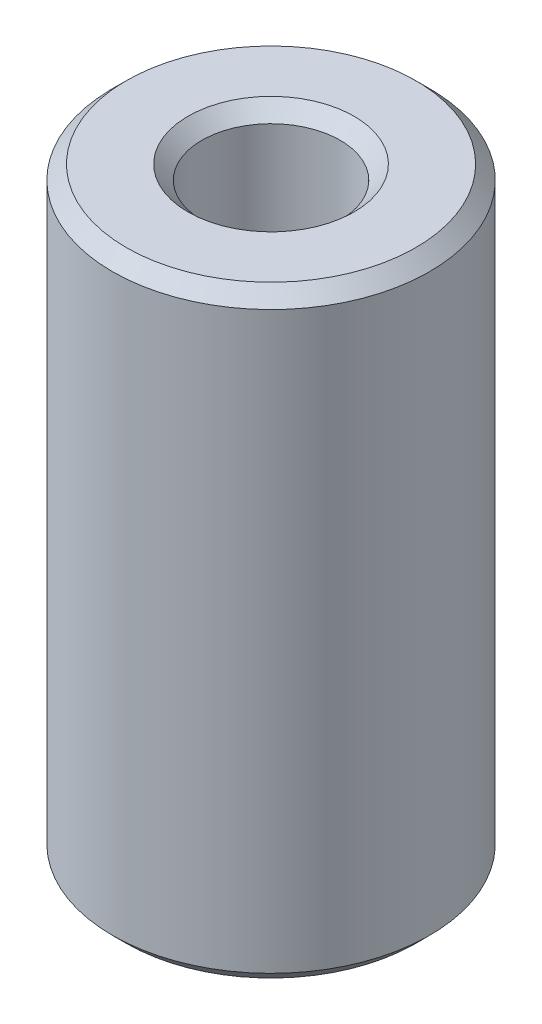
ISO-10303-21;
HEADER;
FILE_DESCRIPTION(('STEP AP214'),'2;1');
FILE_NAME('part.step','',(''),(''),'','','');
FILE_SCHEMA(('AUTOMOTIVE_DESIGN { 1 0 10303 214 1 1 1 1 }'));
ENDSEC;
DATA;
#1=APPLICATION_CONTEXT('core data for automotive mechanical design processes');
#2=APPLICATION_PROTOCOL_DEFINITION('international standard','automotive_design',2000,#1);
#3=PRODUCT_CONTEXT('',#1,'mechanical');
#4=PRODUCT('Part','Part','',(#3));
#5=PRODUCT_RELATED_PRODUCT_CATEGORY('part','',(#4));
#6=PRODUCT_DEFINITION_FORMATION('','',#4);
#7=PRODUCT_DEFINITION_CONTEXT('part definition',#1,'design');
#8=PRODUCT_DEFINITION('design','',#6,#7);
#9=PRODUCT_DEFINITION_SHAPE('','',#8);
#10=(LENGTH_UNIT() NAMED_UNIT(*) SI_UNIT(.MILLI.,.METRE.));
#11=(NAMED_UNIT(*) PLANE_ANGLE_UNIT() SI_UNIT($,.RADIAN.));
#12=(NAMED_UNIT(*) SI_UNIT($,.STERADIAN.) SOLID_ANGLE_UNIT());
#13=UNCERTAINTY_MEASURE_WITH_UNIT(LENGTH_MEASURE(1.E-05),#10,'distance_accuracy_value','');
#14=(GEOMETRIC_REPRESENTATION_CONTEXT(3) GLOBAL_UNCERTAINTY_ASSIGNED_CONTEXT((#13)) GLOBAL_UNIT_ASSIGNED_CONTEXT((#10,
#11,#12)) REPRESENTATION_CONTEXT('',''));
#15=CARTESIAN_POINT('',(0.,0.,0.));
#16=DIRECTION('',(0.,0.,1.));
#17=DIRECTION('',(1.,0.,0.));
#18=AXIS2_PLACEMENT_3D('',#15,#16,#17);
#19=CARTESIAN_POINT('',(0.,152.033433128775,0.));
#20=DIRECTION('',(0.,-1.,0.));
#21=DIRECTION('',(0.,0.,-1.));
#22=AXIS2_PLACEMENT_3D('',#19,#20,#21);
#23=CYLINDRICAL_SURFACE('',#22,40.);
#24=CARTESIAN_POINT('',(0.,3.50004385810501,0.));
#25=DIRECTION('',(0.,1.,0.));
#26=DIRECTION('',(0.,0.,1.));
#27=AXIS2_PLACEMENT_3D('',#24,#25,#26);
#28=CIRCLE('',#27,40.);
#29=CARTESIAN_POINT('',(0.,3.50004385810501,40.));
#30=VERTEX_POINT('',#29);
#31=EDGE_CURVE('E10',#30,#30,#28,.T.);
#32=ORIENTED_EDGE('',*,*,#31,.T.);
#33=EDGE_LOOP('',(#32));
#34=FACE_BOUND('',#33,.T.);
#35=CARTESIAN_POINT('',(0.,148.53338927067,0.));
#36=DIRECTION('',(0.,1.,0.));
#37=DIRECTION('',(0.,0.,1.));
#38=AXIS2_PLACEMENT_3D('',#35,#36,#37);
#39=CIRCLE('',#38,40.);
#40=CARTESIAN_POINT('',(0.,148.53338927067,40.));
#41=VERTEX_POINT('',#40);
#42=EDGE_CURVE('E50',#41,#41,#39,.F.);
#43=ORIENTED_EDGE('',*,*,#42,.T.);
#44=EDGE_LOOP('',(#43));
#45=FACE_BOUND('',#44,.T.);
#46=ADVANCED_FACE('F39',(#34,#45),#23,.T.);
#47=CARTESIAN_POINT('',(0.,152.033433128775,0.));
#48=DIRECTION('',(0.,1.,0.));
#49=DIRECTION('',(0.,0.,1.));
#50=AXIS2_PLACEMENT_3D('',#47,#48,#49);
#51=PLANE('',#50);
#52=CARTESIAN_POINT('',(0.,152.033433128775,0.));
#53=DIRECTION('',(0.,1.,0.));
#54=DIRECTION('',(0.,0.,1.));
#55=AXIS2_PLACEMENT_3D('',#52,#53,#54);
#56=CIRCLE('',#55,20.9447488854168);
#57=CARTESIAN_POINT('',(0.,152.033433128775,20.9447488854168));
#58=VERTEX_POINT('',#57);
#59=EDGE_CURVE('E58',#58,#58,#56,.F.);
#60=ORIENTED_EDGE('',*,*,#59,.T.);
#61=EDGE_LOOP('',(#60));
#62=FACE_BOUND('',#61,.T.);
#63=CARTESIAN_POINT('',(0.,152.033433128775,0.));
#64=DIRECTION('',(0.,1.,0.));
#65=DIRECTION('',(0.,0.,1.));
#66=AXIS2_PLACEMENT_3D('',#63,#64,#65);
#67=CIRCLE('',#66,36.499956141895);
#68=CARTESIAN_POINT('',(0.,152.033433128775,36.499956141895));
#69=VERTEX_POINT('',#68);
#70=EDGE_CURVE('E61',#69,#69,#67,.T.);
#71=ORIENTED_EDGE('',*,*,#70,.T.);
#72=EDGE_LOOP('',(#71));
#73=FACE_BOUND('',#72,.T.);
#74=ADVANCED_FACE('F88',(#62,#73),#51,.T.);
#75=CARTESIAN_POINT('',(0.,0.,0.));
#76=DIRECTION('',(0.,1.,0.));
#77=DIRECTION('',(0.,0.,1.));
#78=AXIS2_PLACEMENT_3D('',#75,#76,#77);
#79=PLANE('',#78);
#80=CARTESIAN_POINT('',(0.,0.,0.));
#81=DIRECTION('',(0.,1.,0.));
#82=DIRECTION('',(0.,0.,1.));
#83=AXIS2_PLACEMENT_3D('',#80,#81,#82);
#84=CIRCLE('',#83,20.9447488854168);
#85=CARTESIAN_POINT('',(0.,0.,20.9447488854168));
#86=VERTEX_POINT('',#85);
#87=EDGE_CURVE('E51',#86,#86,#84,.T.);
#88=ORIENTED_EDGE('',*,*,#87,.T.);
#89=EDGE_LOOP('',(#88));
#90=FACE_BOUND('',#89,.T.);
#91=CARTESIAN_POINT('',(0.,0.,0.));
#92=DIRECTION('',(0.,1.,0.));
#93=DIRECTION('',(0.,0.,1.));
#94=AXIS2_PLACEMENT_3D('',#91,#92,#93);
#95=CIRCLE('',#94,36.499956141895);
#96=CARTESIAN_POINT('',(0.,0.,36.499956141895));
#97=VERTEX_POINT('',#96);
#98=EDGE_CURVE('E54',#97,#97,#95,.F.);
#99=ORIENTED_EDGE('',*,*,#98,.T.);
#100=EDGE_LOOP('',(#99));
#101=FACE_BOUND('',#100,.T.);
#102=ADVANCED_FACE('F83',(#90,#101),#79,.F.);
#103=CARTESIAN_POINT('',(0.,152.033433128775,0.));
#104=DIRECTION('',(0.,-1.,0.));
#105=DIRECTION('',(0.,0.,-1.));
#106=AXIS2_PLACEMENT_3D('',#103,#104,#105);
#107=CYLINDRICAL_SURFACE('',#106,17.4447050273118);
#108=CARTESIAN_POINT('',(0.,148.53338927067,0.));
#109=DIRECTION('',(0.,1.,0.));
#110=DIRECTION('',(0.,0.,1.));
#111=AXIS2_PLACEMENT_3D('',#108,#109,#110);
#112=CIRCLE('',#111,17.4447050273118);
#113=CARTESIAN_POINT('',(0.,148.53338927067,17.4447050273118));
#114=VERTEX_POINT('',#113);
#115=EDGE_CURVE('E67',#114,#114,#112,.T.);
#116=ORIENTED_EDGE('',*,*,#115,.T.);
#117=EDGE_LOOP('',(#116));
#118=FACE_BOUND('',#117,.T.);
#119=CARTESIAN_POINT('',(0.,3.50004385810507,0.));
#120=DIRECTION('',(0.,1.,0.));
#121=DIRECTION('',(0.,0.,1.));
#122=AXIS2_PLACEMENT_3D('',#119,#120,#121);
#123=CIRCLE('',#122,17.4447050273118);
#124=CARTESIAN_POINT('',(0.,3.50004385810507,17.4447050273118));
#125=VERTEX_POINT('',#124);
#126=EDGE_CURVE('E69',#125,#125,#123,.F.);
#127=ORIENTED_EDGE('',*,*,#126,.T.);
#128=EDGE_LOOP('',(#127));
#129=FACE_BOUND('',#128,.T.);
#130=ADVANCED_FACE('F71',(#118,#129),#107,.F.);
#131=CARTESIAN_POINT('',(0.,148.53338927067,0.));
#132=DIRECTION('',(0.,1.,0.));
#133=DIRECTION('',(0.,0.,1.));
#134=AXIS2_PLACEMENT_3D('',#131,#132,#133);
#135=CONICAL_SURFACE('',#134,17.4447050273118,0.78539816339745);
#136=ORIENTED_EDGE('',*,*,#59,.F.);
#137=EDGE_LOOP('',(#136));
#138=FACE_BOUND('',#137,.T.);
#139=ORIENTED_EDGE('',*,*,#115,.F.);
#140=EDGE_LOOP('',(#139));
#141=FACE_BOUND('',#140,.T.);
#142=ADVANCED_FACE('F77',(#138,#141),#135,.F.);
#143=CARTESIAN_POINT('',(0.,0.,0.));
#144=DIRECTION('',(0.,-1.,0.));
#145=DIRECTION('',(0.,0.,-1.));
#146=AXIS2_PLACEMENT_3D('',#143,#144,#145);
#147=CONICAL_SURFACE('',#146,20.9447488854168,0.785398163397444);
#148=ORIENTED_EDGE('',*,*,#126,.F.);
#149=EDGE_LOOP('',(#148));
#150=FACE_BOUND('',#149,.T.);
#151=ORIENTED_EDGE('',*,*,#87,.F.);
#152=EDGE_LOOP('',(#151));
#153=FACE_BOUND('',#152,.T.);
#154=ADVANCED_FACE('F73',(#150,#153),#147,.F.);
#155=CARTESIAN_POINT('',(0.,3.50004385810501,0.));
#156=DIRECTION('',(0.,1.,0.));
#157=DIRECTION('',(0.,0.,1.));
#158=AXIS2_PLACEMENT_3D('',#155,#156,#157);
#159=CONICAL_SURFACE('',#158,40.,0.785398163397453);
#160=ORIENTED_EDGE('',*,*,#98,.F.);
#161=EDGE_LOOP('',(#160));
#162=FACE_BOUND('',#161,.T.);
#163=ORIENTED_EDGE('',*,*,#31,.F.);
#164=EDGE_LOOP('',(#163));
#165=FACE_BOUND('',#164,.T.);
#166=ADVANCED_FACE('F76',(#162,#165),#159,.T.);
#167=CARTESIAN_POINT('',(0.,152.033433128775,0.));
#168=DIRECTION('',(0.,-1.,0.));
#169=DIRECTION('',(0.,0.,-1.));
#170=AXIS2_PLACEMENT_3D('',#167,#168,#169);
#171=CONICAL_SURFACE('',#170,36.499956141895,0.785398163397447);
#172=ORIENTED_EDGE('',*,*,#42,.F.);
#173=EDGE_LOOP('',(#172));
#174=FACE_BOUND('',#173,.T.);
#175=ORIENTED_EDGE('',*,*,#70,.F.);
#176=EDGE_LOOP('',(#175));
#177=FACE_BOUND('',#176,.T.);
#178=ADVANCED_FACE('F45',(#174,#177),#171,.T.);
#179=CLOSED_SHELL('',(#46,#74,#102,#130,#142,#154,#166,#178));
#180=MANIFOLD_SOLID_BREP('B2',#179);
#181=ADVANCED_BREP_SHAPE_REPRESENTATION('',(#18,#180),#14);
#182=SHAPE_DEFINITION_REPRESENTATION(#9,#181);
ENDSEC;
END-ISO-10303-21;
